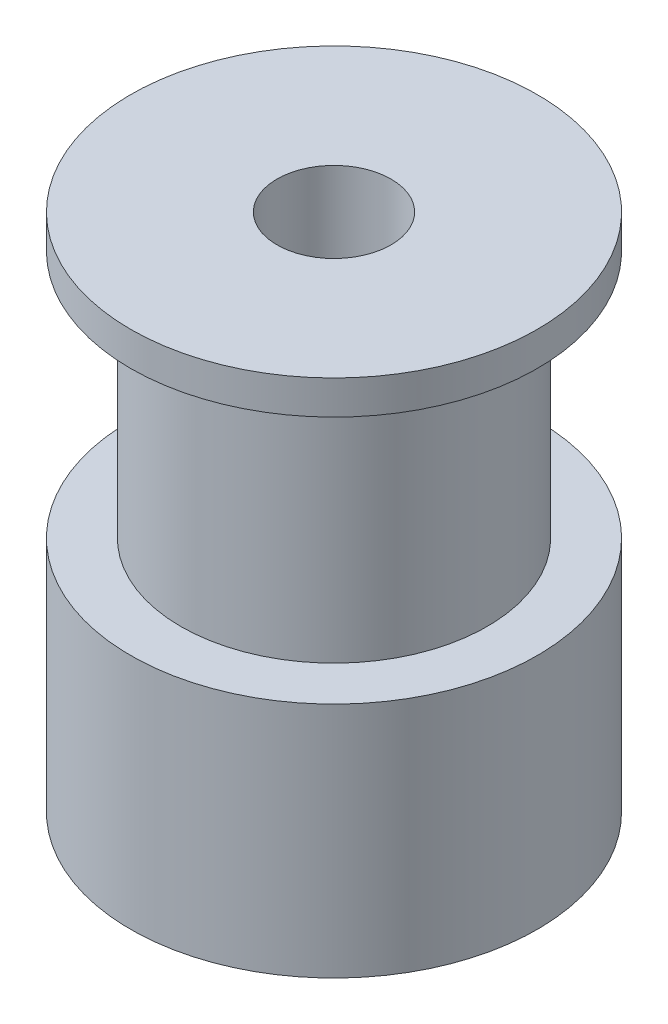
ISO-10303-21;
HEADER;
FILE_DESCRIPTION(('STEP AP214'),'2;1');
FILE_NAME('part.step','',(''),(''),'','','');
FILE_SCHEMA(('AUTOMOTIVE_DESIGN { 1 0 10303 214 1 1 1 1 }'));
ENDSEC;
DATA;
#1=APPLICATION_CONTEXT('core data for automotive mechanical design processes');
#2=APPLICATION_PROTOCOL_DEFINITION('international standard','automotive_design',2000,#1);
#3=PRODUCT_CONTEXT('',#1,'mechanical');
#4=PRODUCT('Part','Part','',(#3));
#5=PRODUCT_RELATED_PRODUCT_CATEGORY('part','',(#4));
#6=PRODUCT_DEFINITION_FORMATION('','',#4);
#7=PRODUCT_DEFINITION_CONTEXT('part definition',#1,'design');
#8=PRODUCT_DEFINITION('design','',#6,#7);
#9=PRODUCT_DEFINITION_SHAPE('','',#8);
#10=(LENGTH_UNIT() NAMED_UNIT(*) SI_UNIT(.MILLI.,.METRE.));
#11=(NAMED_UNIT(*) PLANE_ANGLE_UNIT() SI_UNIT($,.RADIAN.));
#12=(NAMED_UNIT(*) SI_UNIT($,.STERADIAN.) SOLID_ANGLE_UNIT());
#13=UNCERTAINTY_MEASURE_WITH_UNIT(LENGTH_MEASURE(1.E-05),#10,'distance_accuracy_value','');
#14=(GEOMETRIC_REPRESENTATION_CONTEXT(3) GLOBAL_UNCERTAINTY_ASSIGNED_CONTEXT((#13)) GLOBAL_UNIT_ASSIGNED_CONTEXT((#10,
#11,#12)) REPRESENTATION_CONTEXT('',''));
#15=CARTESIAN_POINT('',(0.,0.,0.));
#16=DIRECTION('',(0.,0.,1.));
#17=DIRECTION('',(1.,0.,0.));
#18=AXIS2_PLACEMENT_3D('',#15,#16,#17);
#19=CARTESIAN_POINT('',(0.,11.,0.));
#20=DIRECTION('',(0.,-1.,0.));
#21=DIRECTION('',(0.,0.,-1.));
#22=AXIS2_PLACEMENT_3D('',#19,#20,#21);
#23=CYLINDRICAL_SURFACE('',#22,6.78);
#24=CARTESIAN_POINT('',(0.,11.,0.));
#25=DIRECTION('',(0.,1.,0.));
#26=DIRECTION('',(0.,0.,1.));
#27=AXIS2_PLACEMENT_3D('',#24,#25,#26);
#28=CIRCLE('',#27,6.78);
#29=CARTESIAN_POINT('',(0.,11.,6.78));
#30=VERTEX_POINT('',#29);
#31=EDGE_CURVE('E10',#30,#30,#28,.T.);
#32=ORIENTED_EDGE('',*,*,#31,.F.);
#33=EDGE_LOOP('',(#32));
#34=FACE_BOUND('',#33,.T.);
#35=CARTESIAN_POINT('',(0.,0.,0.));
#36=DIRECTION('',(0.,1.,0.));
#37=DIRECTION('',(0.,0.,1.));
#38=AXIS2_PLACEMENT_3D('',#35,#36,#37);
#39=CIRCLE('',#38,6.78);
#40=CARTESIAN_POINT('',(0.,0.,6.78));
#41=VERTEX_POINT('',#40);
#42=EDGE_CURVE('E40',#41,#41,#39,.T.);
#43=ORIENTED_EDGE('',*,*,#42,.T.);
#44=EDGE_LOOP('',(#43));
#45=FACE_BOUND('',#44,.T.);
#46=ADVANCED_FACE('F37',(#34,#45),#23,.T.);
#47=CARTESIAN_POINT('',(0.,12.5,0.));
#48=DIRECTION('',(0.,-1.,0.));
#49=DIRECTION('',(0.,0.,-1.));
#50=AXIS2_PLACEMENT_3D('',#47,#48,#49);
#51=CYLINDRICAL_SURFACE('',#50,9.);
#52=CARTESIAN_POINT('',(0.,12.5,0.));
#53=DIRECTION('',(0.,1.,0.));
#54=DIRECTION('',(0.,0.,1.));
#55=AXIS2_PLACEMENT_3D('',#52,#53,#54);
#56=CIRCLE('',#55,9.);
#57=CARTESIAN_POINT('',(0.,12.5,9.));
#58=VERTEX_POINT('',#57);
#59=EDGE_CURVE('E45',#58,#58,#56,.T.);
#60=ORIENTED_EDGE('',*,*,#59,.F.);
#61=EDGE_LOOP('',(#60));
#62=FACE_BOUND('',#61,.T.);
#63=CARTESIAN_POINT('',(0.,11.,0.));
#64=DIRECTION('',(0.,1.,0.));
#65=DIRECTION('',(0.,0.,1.));
#66=AXIS2_PLACEMENT_3D('',#63,#64,#65);
#67=CIRCLE('',#66,9.);
#68=CARTESIAN_POINT('',(0.,11.,9.));
#69=VERTEX_POINT('',#68);
#70=EDGE_CURVE('E50',#69,#69,#67,.T.);
#71=ORIENTED_EDGE('',*,*,#70,.T.);
#72=EDGE_LOOP('',(#71));
#73=FACE_BOUND('',#72,.T.);
#74=ADVANCED_FACE('F103',(#62,#73),#51,.T.);
#75=CARTESIAN_POINT('',(0.,12.5,0.));
#76=DIRECTION('',(0.,1.,0.));
#77=DIRECTION('',(0.,0.,1.));
#78=AXIS2_PLACEMENT_3D('',#75,#76,#77);
#79=PLANE('',#78);
#80=CARTESIAN_POINT('',(0.,12.5,0.));
#81=DIRECTION('',(0.,-1.,0.));
#82=DIRECTION('',(0.,0.,-1.));
#83=AXIS2_PLACEMENT_3D('',#80,#81,#82);
#84=CIRCLE('',#83,2.525);
#85=CARTESIAN_POINT('',(0.,12.5,-2.525));
#86=VERTEX_POINT('',#85);
#87=EDGE_CURVE('E61',#86,#86,#84,.T.);
#88=ORIENTED_EDGE('',*,*,#87,.T.);
#89=EDGE_LOOP('',(#88));
#90=FACE_BOUND('',#89,.T.);
#91=ORIENTED_EDGE('',*,*,#59,.T.);
#92=EDGE_LOOP('',(#91));
#93=FACE_BOUND('',#92,.T.);
#94=ADVANCED_FACE('F73',(#90,#93),#79,.T.);
#95=CARTESIAN_POINT('',(0.,11.,0.));
#96=DIRECTION('',(0.,1.,0.));
#97=DIRECTION('',(0.,0.,1.));
#98=AXIS2_PLACEMENT_3D('',#95,#96,#97);
#99=PLANE('',#98);
#100=ORIENTED_EDGE('',*,*,#31,.T.);
#101=EDGE_LOOP('',(#100));
#102=FACE_BOUND('',#101,.T.);
#103=ORIENTED_EDGE('',*,*,#70,.F.);
#104=EDGE_LOOP('',(#103));
#105=FACE_BOUND('',#104,.T.);
#106=ADVANCED_FACE('F92',(#102,#105),#99,.F.);
#107=CARTESIAN_POINT('',(0.,-10.5,0.));
#108=DIRECTION('',(0.,1.,0.));
#109=DIRECTION('',(0.,0.,1.));
#110=AXIS2_PLACEMENT_3D('',#107,#108,#109);
#111=CYLINDRICAL_SURFACE('',#110,9.);
#112=CARTESIAN_POINT('',(0.,-10.5,0.));
#113=DIRECTION('',(0.,-1.,0.));
#114=DIRECTION('',(0.,0.,-1.));
#115=AXIS2_PLACEMENT_3D('',#112,#113,#114);
#116=CIRCLE('',#115,9.);
#117=CARTESIAN_POINT('',(0.,-10.5,-9.));
#118=VERTEX_POINT('',#117);
#119=EDGE_CURVE('E60',#118,#118,#116,.T.);
#120=ORIENTED_EDGE('',*,*,#119,.F.);
#121=EDGE_LOOP('',(#120));
#122=FACE_BOUND('',#121,.T.);
#123=CARTESIAN_POINT('',(0.,0.,0.));
#124=DIRECTION('',(0.,-1.,0.));
#125=DIRECTION('',(0.,0.,-1.));
#126=AXIS2_PLACEMENT_3D('',#123,#124,#125);
#127=CIRCLE('',#126,9.);
#128=CARTESIAN_POINT('',(0.,0.,-9.));
#129=VERTEX_POINT('',#128);
#130=EDGE_CURVE('E56',#129,#129,#127,.T.);
#131=ORIENTED_EDGE('',*,*,#130,.T.);
#132=EDGE_LOOP('',(#131));
#133=FACE_BOUND('',#132,.T.);
#134=ADVANCED_FACE('F86',(#122,#133),#111,.T.);
#135=CARTESIAN_POINT('',(0.,-10.5,0.));
#136=DIRECTION('',(0.,-1.,0.));
#137=DIRECTION('',(0.,0.,-1.));
#138=AXIS2_PLACEMENT_3D('',#135,#136,#137);
#139=PLANE('',#138);
#140=CARTESIAN_POINT('',(0.,-10.5,0.));
#141=DIRECTION('',(0.,-1.,0.));
#142=DIRECTION('',(0.,0.,-1.));
#143=AXIS2_PLACEMENT_3D('',#140,#141,#142);
#144=CIRCLE('',#143,2.525);
#145=CARTESIAN_POINT('',(0.,-10.5,-2.525));
#146=VERTEX_POINT('',#145);
#147=EDGE_CURVE('E65',#146,#146,#144,.T.);
#148=ORIENTED_EDGE('',*,*,#147,.F.);
#149=EDGE_LOOP('',(#148));
#150=FACE_BOUND('',#149,.T.);
#151=ORIENTED_EDGE('',*,*,#119,.T.);
#152=EDGE_LOOP('',(#151));
#153=FACE_BOUND('',#152,.T.);
#154=ADVANCED_FACE('F83',(#150,#153),#139,.T.);
#155=CARTESIAN_POINT('',(0.,0.,0.));
#156=DIRECTION('',(0.,-1.,0.));
#157=DIRECTION('',(0.,0.,-1.));
#158=AXIS2_PLACEMENT_3D('',#155,#156,#157);
#159=PLANE('',#158);
#160=ORIENTED_EDGE('',*,*,#42,.F.);
#161=EDGE_LOOP('',(#160));
#162=FACE_BOUND('',#161,.T.);
#163=ORIENTED_EDGE('',*,*,#130,.F.);
#164=EDGE_LOOP('',(#163));
#165=FACE_BOUND('',#164,.T.);
#166=ADVANCED_FACE('F79',(#162,#165),#159,.F.);
#167=CARTESIAN_POINT('',(0.,12.5,0.));
#168=DIRECTION('',(0.,-1.,0.));
#169=DIRECTION('',(0.,0.,-1.));
#170=AXIS2_PLACEMENT_3D('',#167,#168,#169);
#171=CYLINDRICAL_SURFACE('',#170,2.525);
#172=ORIENTED_EDGE('',*,*,#87,.F.);
#173=EDGE_LOOP('',(#172));
#174=FACE_BOUND('',#173,.T.);
#175=ORIENTED_EDGE('',*,*,#147,.T.);
#176=EDGE_LOOP('',(#175));
#177=FACE_BOUND('',#176,.T.);
#178=ADVANCED_FACE('F76',(#174,#177),#171,.F.);
#179=CLOSED_SHELL('',(#46,#74,#94,#106,#134,#154,#166,#178));
#180=MANIFOLD_SOLID_BREP('B2',#179);
#181=ADVANCED_BREP_SHAPE_REPRESENTATION('',(#18,#180),#14);
#182=SHAPE_DEFINITION_REPRESENTATION(#9,#181);
ENDSEC;
END-ISO-10303-21;
